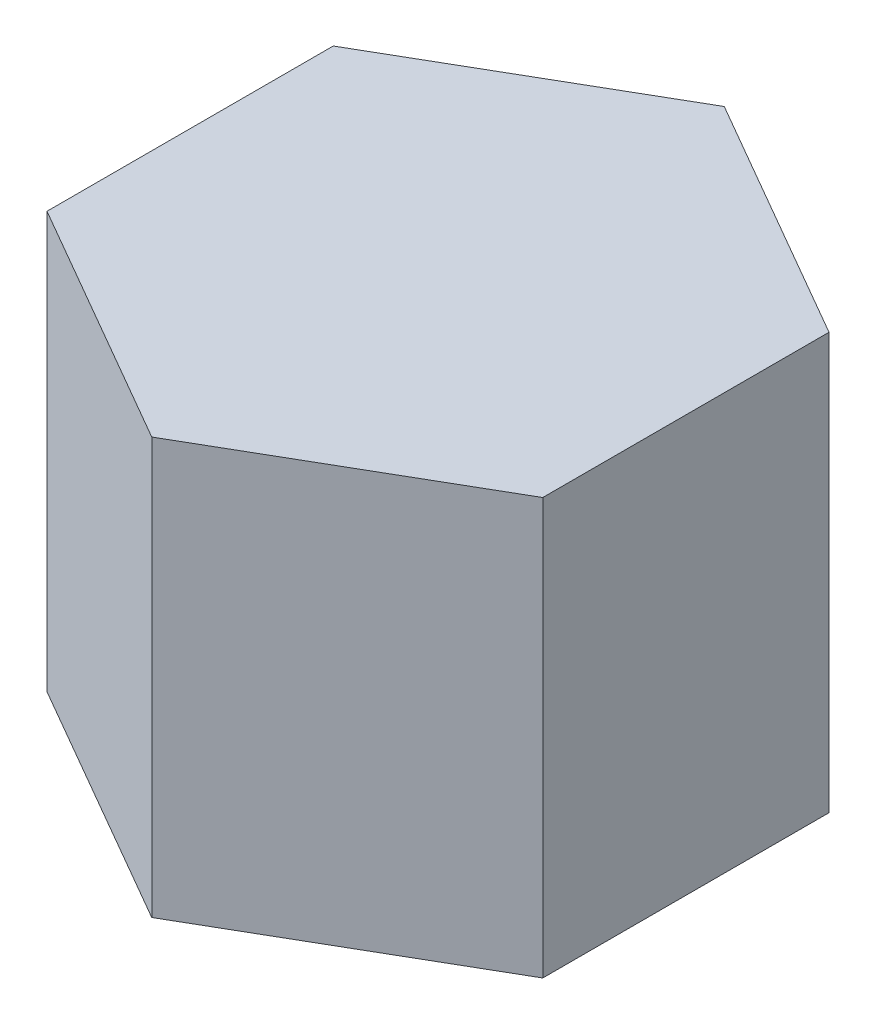
ISO-10303-21;
HEADER;
FILE_DESCRIPTION(('STEP AP214'),'2;1');
FILE_NAME('part.step','',(''),(''),'','','');
FILE_SCHEMA(('AUTOMOTIVE_DESIGN { 1 0 10303 214 1 1 1 1 }'));
ENDSEC;
DATA;
#1=APPLICATION_CONTEXT('core data for automotive mechanical design processes');
#2=APPLICATION_PROTOCOL_DEFINITION('international standard','automotive_design',2000,#1);
#3=PRODUCT_CONTEXT('',#1,'mechanical');
#4=PRODUCT('Part','Part','',(#3));
#5=PRODUCT_RELATED_PRODUCT_CATEGORY('part','',(#4));
#6=PRODUCT_DEFINITION_FORMATION('','',#4);
#7=PRODUCT_DEFINITION_CONTEXT('part definition',#1,'design');
#8=PRODUCT_DEFINITION('design','',#6,#7);
#9=PRODUCT_DEFINITION_SHAPE('','',#8);
#10=(LENGTH_UNIT() NAMED_UNIT(*) SI_UNIT(.MILLI.,.METRE.));
#11=(NAMED_UNIT(*) PLANE_ANGLE_UNIT() SI_UNIT($,.RADIAN.));
#12=(NAMED_UNIT(*) SI_UNIT($,.STERADIAN.) SOLID_ANGLE_UNIT());
#13=UNCERTAINTY_MEASURE_WITH_UNIT(LENGTH_MEASURE(1.E-05),#10,'distance_accuracy_value','');
#14=(GEOMETRIC_REPRESENTATION_CONTEXT(3) GLOBAL_UNCERTAINTY_ASSIGNED_CONTEXT((#13)) GLOBAL_UNIT_ASSIGNED_CONTEXT((#10,
#11,#12)) REPRESENTATION_CONTEXT('',''));
#15=CARTESIAN_POINT('',(0.,0.,0.));
#16=DIRECTION('',(0.,0.,1.));
#17=DIRECTION('',(1.,0.,0.));
#18=AXIS2_PLACEMENT_3D('',#15,#16,#17);
#19=CARTESIAN_POINT('',(203.339551417382,-147.556598747966,289.949920412926));
#20=DIRECTION('',(-0.499999999999943,0.,-0.866025403784471));
#21=DIRECTION('',(-0.866025403784471,0.,0.499999999999943));
#22=AXIS2_PLACEMENT_3D('',#19,#20,#21);
#23=PLANE('',#22);
#24=CARTESIAN_POINT('',(203.642660308706,-147.047793579175,289.774920412926));
#25=DIRECTION('',(-0.866025403784471,0.,0.499999999999943));
#26=VECTOR('',#25,1.);
#27=LINE('',#24,#26);
#28=CARTESIAN_POINT('',(203.642660308706,-147.047793579175,289.774920412926));
#29=VERTEX_POINT('',#28);
#30=CARTESIAN_POINT('',(203.339551417382,-147.047793579175,289.949920412926));
#31=VERTEX_POINT('',#30);
#32=EDGE_CURVE('E170',#29,#31,#27,.T.);
#33=ORIENTED_EDGE('',*,*,#32,.T.);
#34=CARTESIAN_POINT('',(203.339551417382,-147.556598747966,289.949920412926));
#35=DIRECTION('',(0.,1.,0.));
#36=VECTOR('',#35,1.);
#37=LINE('',#34,#36);
#38=CARTESIAN_POINT('',(203.339551417382,-147.556598747966,289.949920412926));
#39=VERTEX_POINT('',#38);
#40=EDGE_CURVE('E35',#39,#31,#37,.T.);
#41=ORIENTED_EDGE('',*,*,#40,.F.);
#42=CARTESIAN_POINT('',(203.642660308706,-147.556598747966,289.774920412926));
#43=DIRECTION('',(-0.866025403784471,0.,0.499999999999943));
#44=VECTOR('',#43,1.);
#45=LINE('',#42,#44);
#46=CARTESIAN_POINT('',(203.642660308706,-147.556598747966,289.774920412926));
#47=VERTEX_POINT('',#46);
#48=EDGE_CURVE('E159',#47,#39,#45,.T.);
#49=ORIENTED_EDGE('',*,*,#48,.F.);
#50=CARTESIAN_POINT('',(203.642660308706,-147.556598747966,289.774920412926));
#51=DIRECTION('',(0.,1.,0.));
#52=VECTOR('',#51,1.);
#53=LINE('',#50,#52);
#54=EDGE_CURVE('E10',#47,#29,#53,.T.);
#55=ORIENTED_EDGE('',*,*,#54,.T.);
#56=EDGE_LOOP('',(#33,#41,#49,#55));
#57=FACE_BOUND('',#56,.T.);
#58=ADVANCED_FACE('F16',(#57),#23,.F.);
#59=CARTESIAN_POINT('',(203.642660308706,-147.556598747966,291.594471220494));
#60=DIRECTION('',(-1.,0.,0.));
#61=DIRECTION('',(0.,-1.,0.));
#62=AXIS2_PLACEMENT_3D('',#59,#60,#61);
#63=PLANE('',#62);
#64=CARTESIAN_POINT('',(203.642660308706,-147.047793579175,289.424920412926));
#65=DIRECTION('',(0.,0.,1.));
#66=VECTOR('',#65,1.);
#67=LINE('',#64,#66);
#68=CARTESIAN_POINT('',(203.642660308706,-147.047793579175,289.424920412926));
#69=VERTEX_POINT('',#68);
#70=EDGE_CURVE('E167',#69,#29,#67,.T.);
#71=ORIENTED_EDGE('',*,*,#70,.T.);
#72=ORIENTED_EDGE('',*,*,#54,.F.);
#73=CARTESIAN_POINT('',(203.642660308706,-147.556598747966,289.424920412926));
#74=DIRECTION('',(0.,0.,1.));
#75=VECTOR('',#74,1.);
#76=LINE('',#73,#75);
#77=CARTESIAN_POINT('',(203.642660308706,-147.556598747966,289.424920412926));
#78=VERTEX_POINT('',#77);
#79=EDGE_CURVE('E156',#78,#47,#76,.T.);
#80=ORIENTED_EDGE('',*,*,#79,.F.);
#81=CARTESIAN_POINT('',(203.642660308706,-147.556598747966,289.424920412926));
#82=DIRECTION('',(0.,1.,0.));
#83=VECTOR('',#82,1.);
#84=LINE('',#81,#83);
#85=EDGE_CURVE('E27',#78,#69,#84,.T.);
#86=ORIENTED_EDGE('',*,*,#85,.T.);
#87=EDGE_LOOP('',(#71,#72,#80,#86));
#88=FACE_BOUND('',#87,.T.);
#89=ADVANCED_FACE('F189',(#88),#63,.F.);
#90=CARTESIAN_POINT('',(203.642660308706,-147.556598747966,289.424920412926));
#91=DIRECTION('',(-0.499999999999978,0.,0.866025403784452));
#92=DIRECTION('',(0.866025403784452,0.,0.499999999999978));
#93=AXIS2_PLACEMENT_3D('',#90,#91,#92);
#94=PLANE('',#93);
#95=CARTESIAN_POINT('',(203.339551417382,-147.047793579175,289.249920412926));
#96=DIRECTION('',(0.866025403784452,0.,0.499999999999978));
#97=VECTOR('',#96,1.);
#98=LINE('',#95,#97);
#99=CARTESIAN_POINT('',(203.339551417382,-147.047793579175,289.249920412926));
#100=VERTEX_POINT('',#99);
#101=EDGE_CURVE('E163',#100,#69,#98,.T.);
#102=ORIENTED_EDGE('',*,*,#101,.T.);
#103=ORIENTED_EDGE('',*,*,#85,.F.);
#104=CARTESIAN_POINT('',(203.339551417382,-147.556598747966,289.249920412926));
#105=DIRECTION('',(0.866025403784452,0.,0.499999999999978));
#106=VECTOR('',#105,1.);
#107=LINE('',#104,#106);
#108=CARTESIAN_POINT('',(203.339551417382,-147.556598747966,289.249920412926));
#109=VERTEX_POINT('',#108);
#110=EDGE_CURVE('E106',#109,#78,#107,.T.);
#111=ORIENTED_EDGE('',*,*,#110,.F.);
#112=CARTESIAN_POINT('',(203.339551417382,-147.556598747966,289.249920412926));
#113=DIRECTION('',(0.,1.,0.));
#114=VECTOR('',#113,1.);
#115=LINE('',#112,#114);
#116=EDGE_CURVE('E94',#109,#100,#115,.T.);
#117=ORIENTED_EDGE('',*,*,#116,.T.);
#118=EDGE_LOOP('',(#102,#103,#111,#117));
#119=FACE_BOUND('',#118,.T.);
#120=ADVANCED_FACE('F198',(#119),#94,.F.);
#121=CARTESIAN_POINT('',(203.339551417382,-147.556598747966,289.249920412926));
#122=DIRECTION('',(0.499999999999978,0.,0.866025403784452));
#123=DIRECTION('',(0.866025403784452,0.,-0.499999999999978));
#124=AXIS2_PLACEMENT_3D('',#121,#122,#123);
#125=PLANE('',#124);
#126=CARTESIAN_POINT('',(203.036442526057,-147.047793579175,289.424920412926));
#127=DIRECTION('',(0.866025403784452,0.,-0.499999999999978));
#128=VECTOR('',#127,1.);
#129=LINE('',#126,#128);
#130=CARTESIAN_POINT('',(203.036442526057,-147.047793579175,289.424920412926));
#131=VERTEX_POINT('',#130);
#132=EDGE_CURVE('E162',#131,#100,#129,.T.);
#133=ORIENTED_EDGE('',*,*,#132,.T.);
#134=ORIENTED_EDGE('',*,*,#116,.F.);
#135=CARTESIAN_POINT('',(203.036442526057,-147.556598747966,289.424920412926));
#136=DIRECTION('',(0.866025403784452,0.,-0.499999999999978));
#137=VECTOR('',#136,1.);
#138=LINE('',#135,#137);
#139=CARTESIAN_POINT('',(203.036442526057,-147.556598747966,289.424920412926));
#140=VERTEX_POINT('',#139);
#141=EDGE_CURVE('E98',#140,#109,#138,.T.);
#142=ORIENTED_EDGE('',*,*,#141,.F.);
#143=CARTESIAN_POINT('',(203.036442526057,-147.556598747966,289.424920412926));
#144=DIRECTION('',(0.,1.,0.));
#145=VECTOR('',#144,1.);
#146=LINE('',#143,#145);
#147=EDGE_CURVE('E79',#140,#131,#146,.T.);
#148=ORIENTED_EDGE('',*,*,#147,.T.);
#149=EDGE_LOOP('',(#133,#134,#142,#148));
#150=FACE_BOUND('',#149,.T.);
#151=ADVANCED_FACE('F100',(#150),#125,.F.);
#152=CARTESIAN_POINT('',(203.036442526057,-147.556598747966,291.594471220494));
#153=DIRECTION('',(1.,0.,0.));
#154=DIRECTION('',(0.,1.,0.));
#155=AXIS2_PLACEMENT_3D('',#152,#153,#154);
#156=PLANE('',#155);
#157=CARTESIAN_POINT('',(203.036442526057,-147.047793579175,289.774920412926));
#158=DIRECTION('',(0.,0.,-1.));
#159=VECTOR('',#158,1.);
#160=LINE('',#157,#159);
#161=CARTESIAN_POINT('',(203.036442526057,-147.047793579175,289.774920412926));
#162=VERTEX_POINT('',#161);
#163=EDGE_CURVE('E88',#162,#131,#160,.T.);
#164=ORIENTED_EDGE('',*,*,#163,.T.);
#165=ORIENTED_EDGE('',*,*,#147,.F.);
#166=CARTESIAN_POINT('',(203.036442526057,-147.556598747966,289.774920412926));
#167=DIRECTION('',(0.,0.,-1.));
#168=VECTOR('',#167,1.);
#169=LINE('',#166,#168);
#170=CARTESIAN_POINT('',(203.036442526057,-147.556598747966,289.774920412926));
#171=VERTEX_POINT('',#170);
#172=EDGE_CURVE('E84',#171,#140,#169,.T.);
#173=ORIENTED_EDGE('',*,*,#172,.F.);
#174=CARTESIAN_POINT('',(203.036442526057,-147.556598747966,289.774920412926));
#175=DIRECTION('',(0.,1.,0.));
#176=VECTOR('',#175,1.);
#177=LINE('',#174,#176);
#178=EDGE_CURVE('E58',#171,#162,#177,.T.);
#179=ORIENTED_EDGE('',*,*,#178,.T.);
#180=EDGE_LOOP('',(#164,#165,#173,#179));
#181=FACE_BOUND('',#180,.T.);
#182=ADVANCED_FACE('F82',(#181),#156,.F.);
#183=CARTESIAN_POINT('',(203.036442526057,-147.556598747966,289.774920412926));
#184=DIRECTION('',(0.499999999999943,0.,-0.866025403784471));
#185=DIRECTION('',(-0.866025403784471,0.,-0.499999999999943));
#186=AXIS2_PLACEMENT_3D('',#183,#184,#185);
#187=PLANE('',#186);
#188=CARTESIAN_POINT('',(203.339551417382,-147.047793579175,289.949920412926));
#189=DIRECTION('',(-0.866025403784471,0.,-0.499999999999943));
#190=VECTOR('',#189,1.);
#191=LINE('',#188,#190);
#192=EDGE_CURVE('E160',#31,#162,#191,.T.);
#193=ORIENTED_EDGE('',*,*,#192,.T.);
#194=ORIENTED_EDGE('',*,*,#178,.F.);
#195=CARTESIAN_POINT('',(203.339551417382,-147.556598747966,289.949920412926));
#196=DIRECTION('',(-0.866025403784471,0.,-0.499999999999943));
#197=VECTOR('',#196,1.);
#198=LINE('',#195,#197);
#199=EDGE_CURVE('E112',#39,#171,#198,.T.);
#200=ORIENTED_EDGE('',*,*,#199,.F.);
#201=ORIENTED_EDGE('',*,*,#40,.T.);
#202=EDGE_LOOP('',(#193,#194,#200,#201));
#203=FACE_BOUND('',#202,.T.);
#204=ADVANCED_FACE('F131',(#203),#187,.F.);
#205=CARTESIAN_POINT('',(206.491105863044,-147.556598747966,291.594471220494));
#206=DIRECTION('',(0.,1.,0.));
#207=DIRECTION('',(-1.,0.,0.));
#208=AXIS2_PLACEMENT_3D('',#205,#206,#207);
#209=PLANE('',#208);
#210=ORIENTED_EDGE('',*,*,#48,.T.);
#211=ORIENTED_EDGE('',*,*,#199,.T.);
#212=ORIENTED_EDGE('',*,*,#172,.T.);
#213=ORIENTED_EDGE('',*,*,#141,.T.);
#214=ORIENTED_EDGE('',*,*,#110,.T.);
#215=ORIENTED_EDGE('',*,*,#79,.T.);
#216=EDGE_LOOP('',(#210,#211,#212,#213,#214,#215));
#217=FACE_BOUND('',#216,.T.);
#218=ADVANCED_FACE('F111',(#217),#209,.F.);
#219=CARTESIAN_POINT('',(206.491105863044,-147.047793579175,291.594471220494));
#220=DIRECTION('',(0.,1.,0.));
#221=DIRECTION('',(-1.,0.,0.));
#222=AXIS2_PLACEMENT_3D('',#219,#220,#221);
#223=PLANE('',#222);
#224=ORIENTED_EDGE('',*,*,#32,.F.);
#225=ORIENTED_EDGE('',*,*,#70,.F.);
#226=ORIENTED_EDGE('',*,*,#101,.F.);
#227=ORIENTED_EDGE('',*,*,#132,.F.);
#228=ORIENTED_EDGE('',*,*,#163,.F.);
#229=ORIENTED_EDGE('',*,*,#192,.F.);
#230=EDGE_LOOP('',(#224,#225,#226,#227,#228,#229));
#231=FACE_BOUND('',#230,.T.);
#232=ADVANCED_FACE('F130',(#231),#223,.T.);
#233=CLOSED_SHELL('',(#58,#89,#120,#151,#182,#204,#218,#232));
#234=MANIFOLD_SOLID_BREP('B1',#233);
#235=ADVANCED_BREP_SHAPE_REPRESENTATION('',(#18,#234),#14);
#236=SHAPE_DEFINITION_REPRESENTATION(#9,#235);
ENDSEC;
END-ISO-10303-21;
